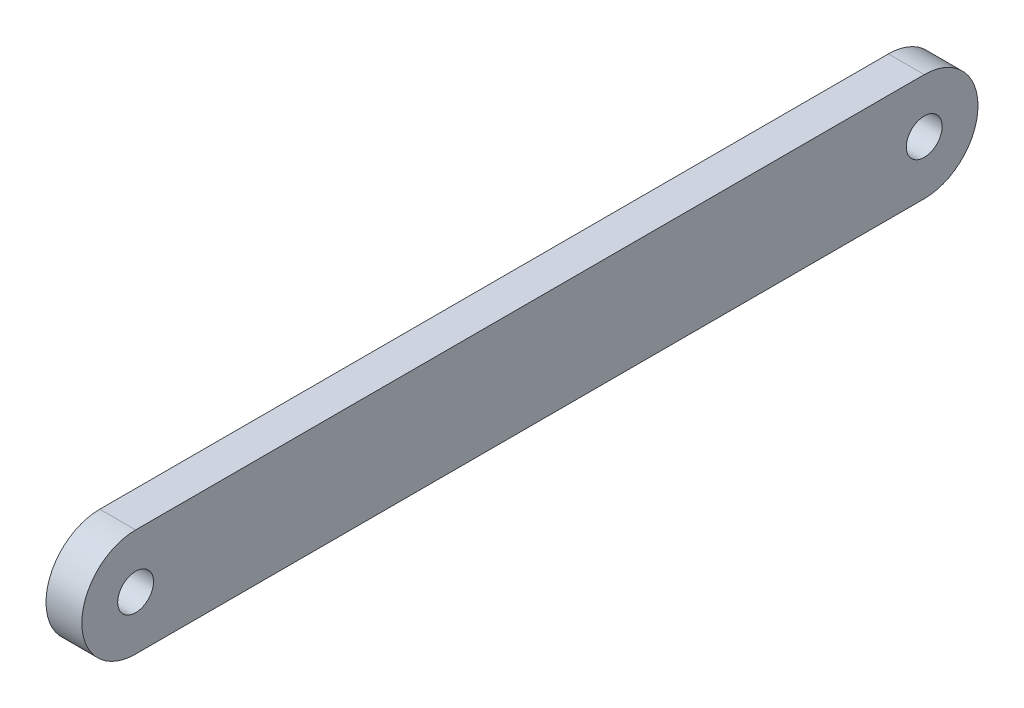
ISO-10303-21;
HEADER;
FILE_DESCRIPTION(('STEP AP214'),'2;1');
FILE_NAME('part.step','',(''),(''),'','','');
FILE_SCHEMA(('AUTOMOTIVE_DESIGN { 1 0 10303 214 1 1 1 1 }'));
ENDSEC;
DATA;
#1=APPLICATION_CONTEXT('core data for automotive mechanical design processes');
#2=APPLICATION_PROTOCOL_DEFINITION('international standard','automotive_design',2000,#1);
#3=PRODUCT_CONTEXT('',#1,'mechanical');
#4=PRODUCT('Part','Part','',(#3));
#5=PRODUCT_RELATED_PRODUCT_CATEGORY('part','',(#4));
#6=PRODUCT_DEFINITION_FORMATION('','',#4);
#7=PRODUCT_DEFINITION_CONTEXT('part definition',#1,'design');
#8=PRODUCT_DEFINITION('design','',#6,#7);
#9=PRODUCT_DEFINITION_SHAPE('','',#8);
#10=(LENGTH_UNIT() NAMED_UNIT(*) SI_UNIT(.MILLI.,.METRE.));
#11=(NAMED_UNIT(*) PLANE_ANGLE_UNIT() SI_UNIT($,.RADIAN.));
#12=(NAMED_UNIT(*) SI_UNIT($,.STERADIAN.) SOLID_ANGLE_UNIT());
#13=UNCERTAINTY_MEASURE_WITH_UNIT(LENGTH_MEASURE(1.E-05),#10,'distance_accuracy_value','');
#14=(GEOMETRIC_REPRESENTATION_CONTEXT(3) GLOBAL_UNCERTAINTY_ASSIGNED_CONTEXT((#13)) GLOBAL_UNIT_ASSIGNED_CONTEXT((#10,
#11,#12)) REPRESENTATION_CONTEXT('',''));
#15=CARTESIAN_POINT('',(0.,0.,0.));
#16=DIRECTION('',(0.,0.,1.));
#17=DIRECTION('',(1.,0.,0.));
#18=AXIS2_PLACEMENT_3D('',#15,#16,#17);
#19=CARTESIAN_POINT('',(10.,0.,110.));
#20=DIRECTION('',(-1.,0.,0.));
#21=DIRECTION('',(0.,0.,1.));
#22=AXIS2_PLACEMENT_3D('',#19,#20,#21);
#23=CYLINDRICAL_SURFACE('',#22,15.);
#24=CARTESIAN_POINT('',(0.,0.,110.));
#25=DIRECTION('',(1.,0.,0.));
#26=DIRECTION('',(0.,0.,-1.));
#27=AXIS2_PLACEMENT_3D('',#24,#25,#26);
#28=CIRCLE('',#27,15.);
#29=CARTESIAN_POINT('',(0.,15.,110.));
#30=VERTEX_POINT('',#29);
#31=CARTESIAN_POINT('',(0.,-15.,110.));
#32=VERTEX_POINT('',#31);
#33=EDGE_CURVE('E96',#30,#32,#28,.T.);
#34=ORIENTED_EDGE('',*,*,#33,.T.);
#35=DIRECTION('',(-1.,0.,0.));
#36=VECTOR('',#35,1.);
#37=CARTESIAN_POINT('',(10.,-15.,110.));
#38=LINE('',#37,#36);
#39=CARTESIAN_POINT('',(10.,-15.,110.));
#40=VERTEX_POINT('',#39);
#41=EDGE_CURVE('E11',#40,#32,#38,.T.);
#42=ORIENTED_EDGE('',*,*,#41,.F.);
#43=CARTESIAN_POINT('',(10.,0.,110.));
#44=DIRECTION('',(1.,0.,0.));
#45=DIRECTION('',(0.,0.,-1.));
#46=AXIS2_PLACEMENT_3D('',#43,#44,#45);
#47=CIRCLE('',#46,15.);
#48=CARTESIAN_POINT('',(10.,15.,110.));
#49=VERTEX_POINT('',#48);
#50=EDGE_CURVE('E84',#49,#40,#47,.T.);
#51=ORIENTED_EDGE('',*,*,#50,.F.);
#52=DIRECTION('',(-1.,0.,0.));
#53=VECTOR('',#52,1.);
#54=CARTESIAN_POINT('',(10.,15.,110.));
#55=LINE('',#54,#53);
#56=EDGE_CURVE('E92',#49,#30,#55,.T.);
#57=ORIENTED_EDGE('',*,*,#56,.T.);
#58=EDGE_LOOP('',(#34,#42,#51,#57));
#59=FACE_BOUND('',#58,.T.);
#60=ADVANCED_FACE('F33',(#59),#23,.T.);
#61=CARTESIAN_POINT('',(10.,-15.,110.));
#62=DIRECTION('',(0.,1.,0.));
#63=DIRECTION('',(0.,0.,1.));
#64=AXIS2_PLACEMENT_3D('',#61,#62,#63);
#65=PLANE('',#64);
#66=DIRECTION('',(0.,0.,-1.));
#67=VECTOR('',#66,1.);
#68=CARTESIAN_POINT('',(0.,-15.,110.));
#69=LINE('',#68,#67);
#70=CARTESIAN_POINT('',(0.,-15.,-110.));
#71=VERTEX_POINT('',#70);
#72=EDGE_CURVE('E88',#32,#71,#69,.T.);
#73=ORIENTED_EDGE('',*,*,#72,.T.);
#74=DIRECTION('',(-1.,0.,0.));
#75=VECTOR('',#74,1.);
#76=CARTESIAN_POINT('',(10.,-15.,-110.));
#77=LINE('',#76,#75);
#78=CARTESIAN_POINT('',(10.,-15.,-110.));
#79=VERTEX_POINT('',#78);
#80=EDGE_CURVE('E41',#79,#71,#77,.T.);
#81=ORIENTED_EDGE('',*,*,#80,.F.);
#82=DIRECTION('',(0.,0.,-1.));
#83=VECTOR('',#82,1.);
#84=CARTESIAN_POINT('',(10.,-15.,110.));
#85=LINE('',#84,#83);
#86=EDGE_CURVE('E79',#40,#79,#85,.T.);
#87=ORIENTED_EDGE('',*,*,#86,.F.);
#88=ORIENTED_EDGE('',*,*,#41,.T.);
#89=EDGE_LOOP('',(#73,#81,#87,#88));
#90=FACE_BOUND('',#89,.T.);
#91=ADVANCED_FACE('F87',(#90),#65,.F.);
#92=CARTESIAN_POINT('',(10.,0.,-110.));
#93=DIRECTION('',(-1.,0.,0.));
#94=DIRECTION('',(0.,0.,1.));
#95=AXIS2_PLACEMENT_3D('',#92,#93,#94);
#96=CYLINDRICAL_SURFACE('',#95,15.);
#97=CARTESIAN_POINT('',(0.,0.,-110.));
#98=DIRECTION('',(1.,0.,0.));
#99=DIRECTION('',(0.,0.,-1.));
#100=AXIS2_PLACEMENT_3D('',#97,#98,#99);
#101=CIRCLE('',#100,15.);
#102=CARTESIAN_POINT('',(0.,15.,-110.));
#103=VERTEX_POINT('',#102);
#104=EDGE_CURVE('E66',#71,#103,#101,.T.);
#105=ORIENTED_EDGE('',*,*,#104,.T.);
#106=DIRECTION('',(-1.,0.,0.));
#107=VECTOR('',#106,1.);
#108=CARTESIAN_POINT('',(10.,15.,-110.));
#109=LINE('',#108,#107);
#110=CARTESIAN_POINT('',(10.,15.,-110.));
#111=VERTEX_POINT('',#110);
#112=EDGE_CURVE('E89',#111,#103,#109,.T.);
#113=ORIENTED_EDGE('',*,*,#112,.F.);
#114=CARTESIAN_POINT('',(10.,0.,-110.));
#115=DIRECTION('',(1.,0.,0.));
#116=DIRECTION('',(0.,0.,-1.));
#117=AXIS2_PLACEMENT_3D('',#114,#115,#116);
#118=CIRCLE('',#117,15.);
#119=EDGE_CURVE('E82',#79,#111,#118,.T.);
#120=ORIENTED_EDGE('',*,*,#119,.F.);
#121=ORIENTED_EDGE('',*,*,#80,.T.);
#122=EDGE_LOOP('',(#105,#113,#120,#121));
#123=FACE_BOUND('',#122,.T.);
#124=ADVANCED_FACE('F90',(#123),#96,.T.);
#125=CARTESIAN_POINT('',(10.,15.,110.));
#126=DIRECTION('',(0.,-1.,0.));
#127=DIRECTION('',(0.,0.,-1.));
#128=AXIS2_PLACEMENT_3D('',#125,#126,#127);
#129=PLANE('',#128);
#130=DIRECTION('',(0.,0.,1.));
#131=VECTOR('',#130,1.);
#132=CARTESIAN_POINT('',(0.,15.,110.));
#133=LINE('',#132,#131);
#134=EDGE_CURVE('E72',#103,#30,#133,.T.);
#135=ORIENTED_EDGE('',*,*,#134,.T.);
#136=ORIENTED_EDGE('',*,*,#56,.F.);
#137=DIRECTION('',(0.,0.,1.));
#138=VECTOR('',#137,1.);
#139=CARTESIAN_POINT('',(10.,15.,110.));
#140=LINE('',#139,#138);
#141=EDGE_CURVE('E49',#111,#49,#140,.T.);
#142=ORIENTED_EDGE('',*,*,#141,.F.);
#143=ORIENTED_EDGE('',*,*,#112,.T.);
#144=EDGE_LOOP('',(#135,#136,#142,#143));
#145=FACE_BOUND('',#144,.T.);
#146=ADVANCED_FACE('F104',(#145),#129,.F.);
#147=CARTESIAN_POINT('',(10.,0.,110.));
#148=DIRECTION('',(1.,0.,0.));
#149=DIRECTION('',(0.,0.,-1.));
#150=AXIS2_PLACEMENT_3D('',#147,#148,#149);
#151=PLANE('',#150);
#152=CARTESIAN_POINT('',(10.,0.,-110.));
#153=DIRECTION('',(1.,0.,0.));
#154=DIRECTION('',(0.,0.,-1.));
#155=AXIS2_PLACEMENT_3D('',#152,#153,#154);
#156=CIRCLE('',#155,5.);
#157=CARTESIAN_POINT('',(10.,0.,-115.));
#158=VERTEX_POINT('',#157);
#159=EDGE_CURVE('E116',#158,#158,#156,.F.);
#160=ORIENTED_EDGE('',*,*,#159,.T.);
#161=EDGE_LOOP('',(#160));
#162=FACE_BOUND('',#161,.T.);
#163=CARTESIAN_POINT('',(10.,0.,110.));
#164=DIRECTION('',(1.,0.,0.));
#165=DIRECTION('',(0.,0.,-1.));
#166=AXIS2_PLACEMENT_3D('',#163,#164,#165);
#167=CIRCLE('',#166,5.);
#168=CARTESIAN_POINT('',(10.,0.,105.));
#169=VERTEX_POINT('',#168);
#170=EDGE_CURVE('E110',#169,#169,#167,.F.);
#171=ORIENTED_EDGE('',*,*,#170,.T.);
#172=EDGE_LOOP('',(#171));
#173=FACE_BOUND('',#172,.T.);
#174=ORIENTED_EDGE('',*,*,#50,.T.);
#175=ORIENTED_EDGE('',*,*,#86,.T.);
#176=ORIENTED_EDGE('',*,*,#119,.T.);
#177=ORIENTED_EDGE('',*,*,#141,.T.);
#178=EDGE_LOOP('',(#174,#175,#176,#177));
#179=FACE_BOUND('',#178,.T.);
#180=ADVANCED_FACE('F80',(#162,#173,#179),#151,.T.);
#181=CARTESIAN_POINT('',(0.,0.,110.));
#182=DIRECTION('',(1.,0.,0.));
#183=DIRECTION('',(0.,0.,-1.));
#184=AXIS2_PLACEMENT_3D('',#181,#182,#183);
#185=PLANE('',#184);
#186=CARTESIAN_POINT('',(0.,0.,-110.));
#187=DIRECTION('',(-1.,0.,0.));
#188=DIRECTION('',(0.,0.,1.));
#189=AXIS2_PLACEMENT_3D('',#186,#187,#188);
#190=CIRCLE('',#189,5.);
#191=CARTESIAN_POINT('',(0.,0.,-105.));
#192=VERTEX_POINT('',#191);
#193=EDGE_CURVE('E113',#192,#192,#190,.T.);
#194=ORIENTED_EDGE('',*,*,#193,.F.);
#195=EDGE_LOOP('',(#194));
#196=FACE_BOUND('',#195,.T.);
#197=CARTESIAN_POINT('',(0.,0.,110.));
#198=DIRECTION('',(-1.,0.,0.));
#199=DIRECTION('',(0.,0.,1.));
#200=AXIS2_PLACEMENT_3D('',#197,#198,#199);
#201=CIRCLE('',#200,5.);
#202=CARTESIAN_POINT('',(0.,0.,115.));
#203=VERTEX_POINT('',#202);
#204=EDGE_CURVE('E99',#203,#203,#201,.T.);
#205=ORIENTED_EDGE('',*,*,#204,.F.);
#206=EDGE_LOOP('',(#205));
#207=FACE_BOUND('',#206,.T.);
#208=ORIENTED_EDGE('',*,*,#33,.F.);
#209=ORIENTED_EDGE('',*,*,#134,.F.);
#210=ORIENTED_EDGE('',*,*,#104,.F.);
#211=ORIENTED_EDGE('',*,*,#72,.F.);
#212=EDGE_LOOP('',(#208,#209,#210,#211));
#213=FACE_BOUND('',#212,.T.);
#214=ADVANCED_FACE('F107',(#196,#207,#213),#185,.F.);
#215=CARTESIAN_POINT('',(10.001,0.,110.));
#216=DIRECTION('',(-1.,0.,0.));
#217=DIRECTION('',(0.,0.,1.));
#218=AXIS2_PLACEMENT_3D('',#215,#216,#217);
#219=CYLINDRICAL_SURFACE('',#218,5.);
#220=ORIENTED_EDGE('',*,*,#170,.F.);
#221=EDGE_LOOP('',(#220));
#222=FACE_BOUND('',#221,.T.);
#223=ORIENTED_EDGE('',*,*,#204,.T.);
#224=EDGE_LOOP('',(#223));
#225=FACE_BOUND('',#224,.T.);
#226=ADVANCED_FACE('F126',(#222,#225),#219,.F.);
#227=CARTESIAN_POINT('',(10.001,0.,-110.));
#228=DIRECTION('',(-1.,0.,0.));
#229=DIRECTION('',(0.,0.,1.));
#230=AXIS2_PLACEMENT_3D('',#227,#228,#229);
#231=CYLINDRICAL_SURFACE('',#230,5.);
#232=ORIENTED_EDGE('',*,*,#159,.F.);
#233=EDGE_LOOP('',(#232));
#234=FACE_BOUND('',#233,.T.);
#235=ORIENTED_EDGE('',*,*,#193,.T.);
#236=EDGE_LOOP('',(#235));
#237=FACE_BOUND('',#236,.T.);
#238=ADVANCED_FACE('F122',(#234,#237),#231,.F.);
#239=CLOSED_SHELL('',(#60,#91,#124,#146,#180,#214,#226,#238));
#240=MANIFOLD_SOLID_BREP('B2',#239);
#241=ADVANCED_BREP_SHAPE_REPRESENTATION('',(#18,#240),#14);
#242=SHAPE_DEFINITION_REPRESENTATION(#9,#241);
ENDSEC;
END-ISO-10303-21;
